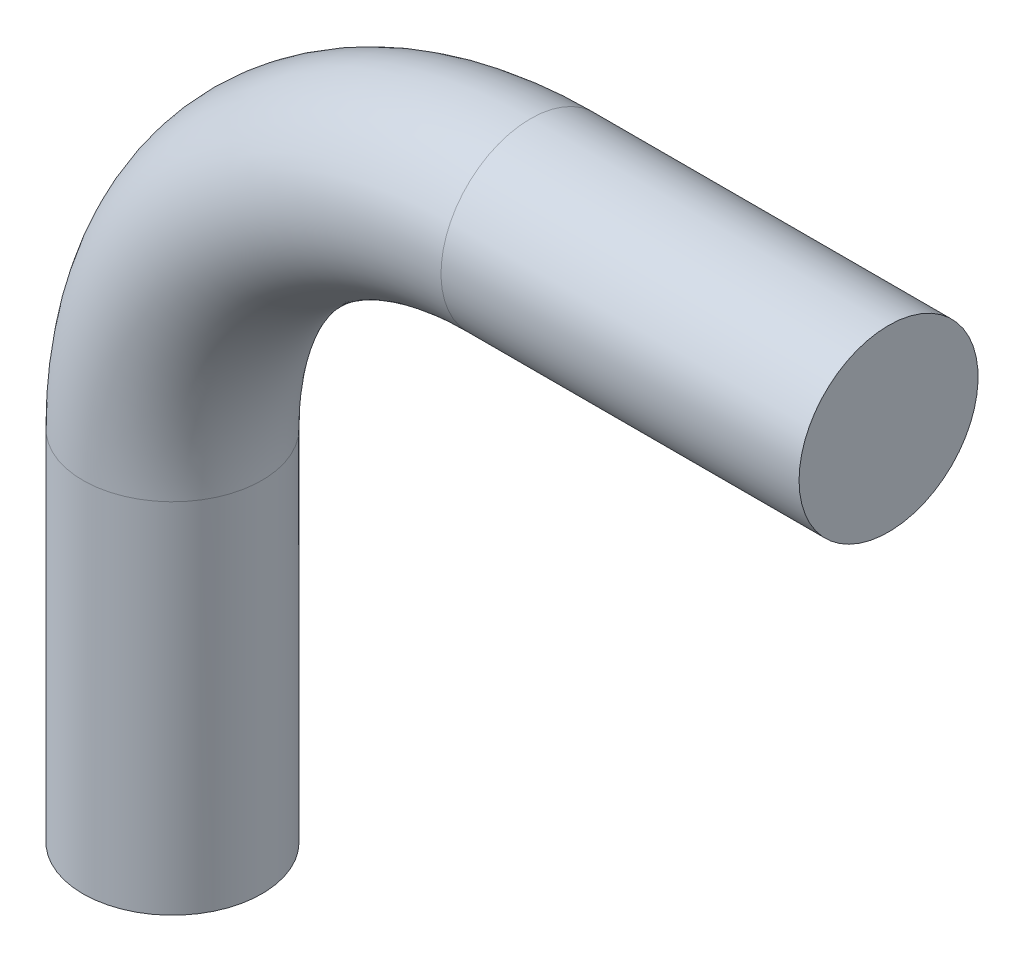
ISO-10303-21;
HEADER;
FILE_DESCRIPTION(('STEP AP214'),'2;1');
FILE_NAME('part.step','',(''),(''),'','','');
FILE_SCHEMA(('AUTOMOTIVE_DESIGN { 1 0 10303 214 1 1 1 1 }'));
ENDSEC;
DATA;
#1=APPLICATION_CONTEXT('core data for automotive mechanical design processes');
#2=APPLICATION_PROTOCOL_DEFINITION('international standard','automotive_design',2000,#1);
#3=PRODUCT_CONTEXT('',#1,'mechanical');
#4=PRODUCT('Part','Part','',(#3));
#5=PRODUCT_RELATED_PRODUCT_CATEGORY('part','',(#4));
#6=PRODUCT_DEFINITION_FORMATION('','',#4);
#7=PRODUCT_DEFINITION_CONTEXT('part definition',#1,'design');
#8=PRODUCT_DEFINITION('design','',#6,#7);
#9=PRODUCT_DEFINITION_SHAPE('','',#8);
#10=(LENGTH_UNIT() NAMED_UNIT(*) SI_UNIT(.MILLI.,.METRE.));
#11=(NAMED_UNIT(*) PLANE_ANGLE_UNIT() SI_UNIT($,.RADIAN.));
#12=(NAMED_UNIT(*) SI_UNIT($,.STERADIAN.) SOLID_ANGLE_UNIT());
#13=UNCERTAINTY_MEASURE_WITH_UNIT(LENGTH_MEASURE(1.E-05),#10,'distance_accuracy_value','');
#14=(GEOMETRIC_REPRESENTATION_CONTEXT(3) GLOBAL_UNCERTAINTY_ASSIGNED_CONTEXT((#13)) GLOBAL_UNIT_ASSIGNED_CONTEXT((#10,
#11,#12)) REPRESENTATION_CONTEXT('',''));
#15=CARTESIAN_POINT('',(0.,0.,0.));
#16=DIRECTION('',(0.,0.,1.));
#17=DIRECTION('',(1.,0.,0.));
#18=AXIS2_PLACEMENT_3D('',#15,#16,#17);
#19=CARTESIAN_POINT('',(100.,200.,0.));
#20=DIRECTION('',(1.,0.,0.));
#21=DIRECTION('',(0.,0.,-1.));
#22=AXIS2_PLACEMENT_3D('',#19,#20,#21);
#23=CYLINDRICAL_SURFACE('',#22,25.);
#24=CARTESIAN_POINT('',(100.,200.,0.));
#25=DIRECTION('',(1.,0.,0.));
#26=DIRECTION('',(0.,0.,1.));
#27=AXIS2_PLACEMENT_3D('',#24,#25,#26);
#28=CIRCLE('',#27,25.);
#29=CARTESIAN_POINT('',(100.,225.,0.));
#30=VERTEX_POINT('',#29);
#31=EDGE_CURVE('E38',#30,#30,#28,.T.);
#32=ORIENTED_EDGE('',*,*,#31,.T.);
#33=EDGE_LOOP('',(#32));
#34=FACE_BOUND('',#33,.T.);
#35=CARTESIAN_POINT('',(200.,200.,0.));
#36=DIRECTION('',(1.,0.,0.));
#37=DIRECTION('',(0.,0.,1.));
#38=AXIS2_PLACEMENT_3D('',#35,#36,#37);
#39=CIRCLE('',#38,25.);
#40=CARTESIAN_POINT('',(200.,200.,25.));
#41=VERTEX_POINT('',#40);
#42=EDGE_CURVE('E10',#41,#41,#39,.T.);
#43=ORIENTED_EDGE('',*,*,#42,.F.);
#44=EDGE_LOOP('',(#43));
#45=FACE_BOUND('',#44,.T.);
#46=ADVANCED_FACE('F32',(#34,#45),#23,.T.);
#47=CARTESIAN_POINT('',(100.,100.,0.));
#48=DIRECTION('',(0.,0.,-1.));
#49=DIRECTION('',(-1.,0.,0.));
#50=AXIS2_PLACEMENT_3D('',#47,#48,#49);
#51=TOROIDAL_SURFACE('',#50,100.,25.);
#52=CARTESIAN_POINT('',(0.,100.,0.));
#53=DIRECTION('',(0.,1.,0.));
#54=DIRECTION('',(0.,0.,1.));
#55=AXIS2_PLACEMENT_3D('',#52,#53,#54);
#56=CIRCLE('',#55,25.);
#57=CARTESIAN_POINT('',(-25.,100.,0.));
#58=VERTEX_POINT('',#57);
#59=EDGE_CURVE('E42',#58,#58,#56,.T.);
#60=CARTESIAN_POINT('',(100.,100.,0.));
#61=DIRECTION('',(0.,0.,-1.));
#62=DIRECTION('',(-1.,0.,0.));
#63=AXIS2_PLACEMENT_3D('',#60,#61,#62);
#64=CIRCLE('',#63,125.);
#65=EDGE_CURVE('',#58,#30,#64,.T.);
#66=ORIENTED_EDGE('',*,*,#59,.T.);
#67=ORIENTED_EDGE('',*,*,#31,.F.);
#68=ORIENTED_EDGE('',*,*,#65,.T.);
#69=ORIENTED_EDGE('',*,*,#65,.F.);
#70=EDGE_LOOP('',(#66,#68,#67,#69));
#71=FACE_BOUND('',#70,.T.);
#72=ADVANCED_FACE('F64',(#71),#51,.T.);
#73=CARTESIAN_POINT('',(0.,100.,0.));
#74=DIRECTION('',(0.,-1.,0.));
#75=DIRECTION('',(0.,0.,-1.));
#76=AXIS2_PLACEMENT_3D('',#73,#74,#75);
#77=CYLINDRICAL_SURFACE('',#76,25.);
#78=ORIENTED_EDGE('',*,*,#59,.F.);
#79=EDGE_LOOP('',(#78));
#80=FACE_BOUND('',#79,.T.);
#81=CARTESIAN_POINT('',(0.,0.,0.));
#82=DIRECTION('',(0.,1.,0.));
#83=DIRECTION('',(0.,0.,1.));
#84=AXIS2_PLACEMENT_3D('',#81,#82,#83);
#85=CIRCLE('',#84,25.);
#86=CARTESIAN_POINT('',(0.,0.,25.));
#87=VERTEX_POINT('',#86);
#88=EDGE_CURVE('E46',#87,#87,#85,.T.);
#89=ORIENTED_EDGE('',*,*,#88,.T.);
#90=EDGE_LOOP('',(#89));
#91=FACE_BOUND('',#90,.T.);
#92=ADVANCED_FACE('F52',(#80,#91),#77,.T.);
#93=CARTESIAN_POINT('',(200.,200.,0.));
#94=DIRECTION('',(1.,0.,0.));
#95=DIRECTION('',(0.,0.,1.));
#96=AXIS2_PLACEMENT_3D('',#93,#94,#95);
#97=PLANE('',#96);
#98=ORIENTED_EDGE('',*,*,#42,.T.);
#99=EDGE_LOOP('',(#98));
#100=FACE_BOUND('',#99,.T.);
#101=ADVANCED_FACE('F56',(#100),#97,.T.);
#102=CARTESIAN_POINT('',(0.,0.,0.));
#103=DIRECTION('',(0.,1.,0.));
#104=DIRECTION('',(0.,0.,1.));
#105=AXIS2_PLACEMENT_3D('',#102,#103,#104);
#106=PLANE('',#105);
#107=ORIENTED_EDGE('',*,*,#88,.F.);
#108=EDGE_LOOP('',(#107));
#109=FACE_BOUND('',#108,.T.);
#110=ADVANCED_FACE('F54',(#109),#106,.F.);
#111=CLOSED_SHELL('',(#46,#72,#92,#101,#110));
#112=MANIFOLD_SOLID_BREP('B2',#111);
#113=ADVANCED_BREP_SHAPE_REPRESENTATION('',(#18,#112),#14);
#114=SHAPE_DEFINITION_REPRESENTATION(#9,#113);
ENDSEC;
END-ISO-10303-21;
